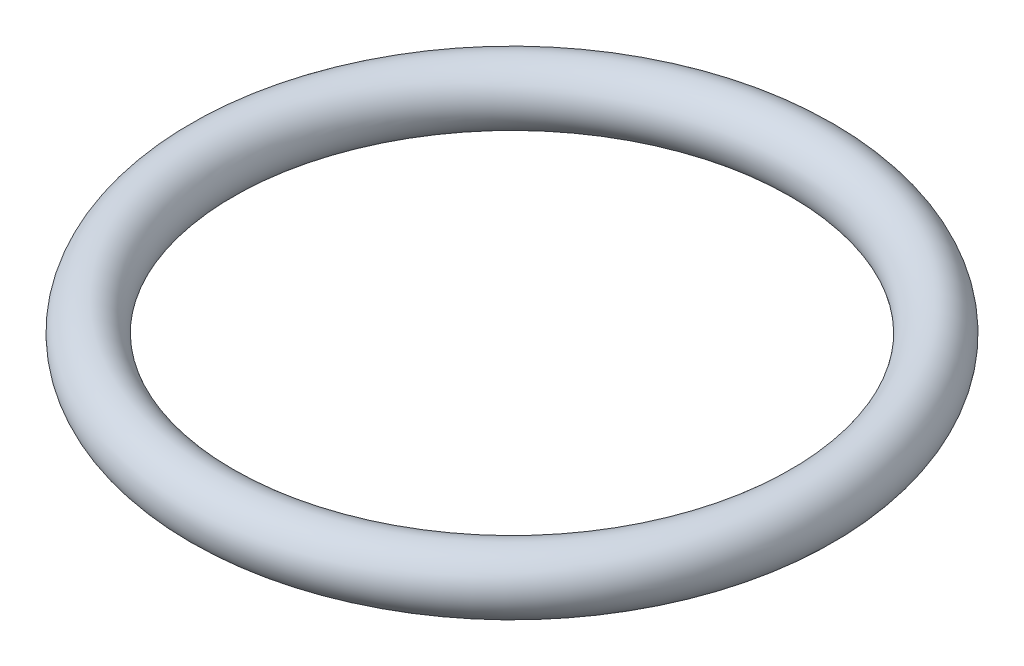
ISO-10303-21;
HEADER;
FILE_DESCRIPTION(('STEP AP214'),'2;1');
FILE_NAME('part.step','',(''),(''),'','','');
FILE_SCHEMA(('AUTOMOTIVE_DESIGN { 1 0 10303 214 1 1 1 1 }'));
ENDSEC;
DATA;
#1=APPLICATION_CONTEXT('core data for automotive mechanical design processes');
#2=APPLICATION_PROTOCOL_DEFINITION('international standard','automotive_design',2000,#1);
#3=PRODUCT_CONTEXT('',#1,'mechanical');
#4=PRODUCT('Part','Part','',(#3));
#5=PRODUCT_RELATED_PRODUCT_CATEGORY('part','',(#4));
#6=PRODUCT_DEFINITION_FORMATION('','',#4);
#7=PRODUCT_DEFINITION_CONTEXT('part definition',#1,'design');
#8=PRODUCT_DEFINITION('design','',#6,#7);
#9=PRODUCT_DEFINITION_SHAPE('','',#8);
#10=(LENGTH_UNIT() NAMED_UNIT(*) SI_UNIT(.MILLI.,.METRE.));
#11=(NAMED_UNIT(*) PLANE_ANGLE_UNIT() SI_UNIT($,.RADIAN.));
#12=(NAMED_UNIT(*) SI_UNIT($,.STERADIAN.) SOLID_ANGLE_UNIT());
#13=UNCERTAINTY_MEASURE_WITH_UNIT(LENGTH_MEASURE(1.E-05),#10,'distance_accuracy_value','');
#14=(GEOMETRIC_REPRESENTATION_CONTEXT(3) GLOBAL_UNCERTAINTY_ASSIGNED_CONTEXT((#13)) GLOBAL_UNIT_ASSIGNED_CONTEXT((#10,
#11,#12)) REPRESENTATION_CONTEXT('',''));
#15=CARTESIAN_POINT('',(0.,0.,0.));
#16=DIRECTION('',(0.,0.,1.));
#17=DIRECTION('',(1.,0.,0.));
#18=AXIS2_PLACEMENT_3D('',#15,#16,#17);
#19=CARTESIAN_POINT('',(0.,0.,0.));
#20=DIRECTION('',(0.,-1.,0.));
#21=DIRECTION('',(0.,0.,-1.));
#22=AXIS2_PLACEMENT_3D('',#19,#20,#21);
#23=TOROIDAL_SURFACE('',#22,8.53907746952014,0.85);
#24=CARTESIAN_POINT('',(0.,0.,-9.38907746952014));
#25=VERTEX_POINT('',#24);
#26=VERTEX_LOOP('',#25);
#27=FACE_BOUND('',#26,.T.);
#28=ADVANCED_FACE('F29',(#27),#23,.T.);
#29=CLOSED_SHELL('',(#28));
#30=MANIFOLD_SOLID_BREP('B2',#29);
#31=ADVANCED_BREP_SHAPE_REPRESENTATION('',(#18,#30),#14);
#32=SHAPE_DEFINITION_REPRESENTATION(#9,#31);
ENDSEC;
END-ISO-10303-21;
